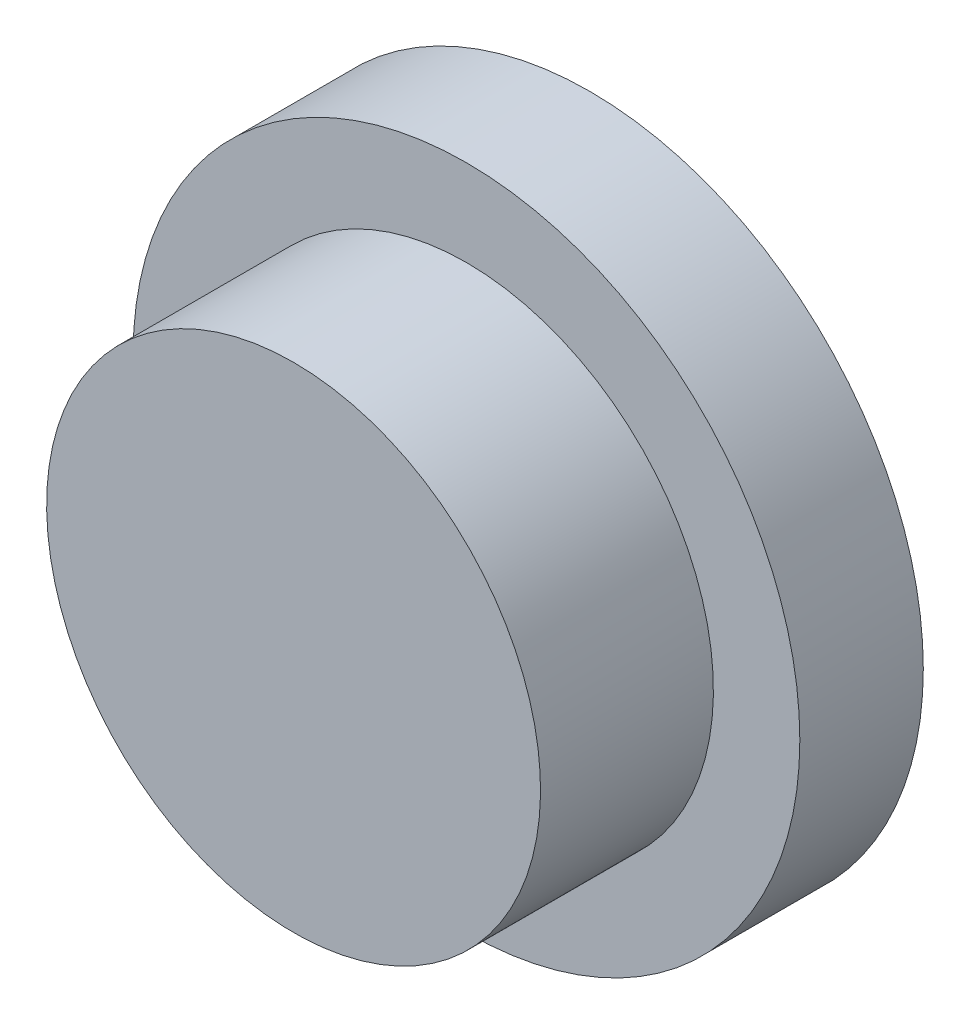
ISO-10303-21;
HEADER;
FILE_DESCRIPTION(('STEP AP214'),'2;1');
FILE_NAME('part.step','',(''),(''),'','','');
FILE_SCHEMA(('AUTOMOTIVE_DESIGN { 1 0 10303 214 1 1 1 1 }'));
ENDSEC;
DATA;
#1=APPLICATION_CONTEXT('core data for automotive mechanical design processes');
#2=APPLICATION_PROTOCOL_DEFINITION('international standard','automotive_design',2000,#1);
#3=PRODUCT_CONTEXT('',#1,'mechanical');
#4=PRODUCT('Part','Part','',(#3));
#5=PRODUCT_RELATED_PRODUCT_CATEGORY('part','',(#4));
#6=PRODUCT_DEFINITION_FORMATION('','',#4);
#7=PRODUCT_DEFINITION_CONTEXT('part definition',#1,'design');
#8=PRODUCT_DEFINITION('design','',#6,#7);
#9=PRODUCT_DEFINITION_SHAPE('','',#8);
#10=(LENGTH_UNIT() NAMED_UNIT(*) SI_UNIT(.MILLI.,.METRE.));
#11=(NAMED_UNIT(*) PLANE_ANGLE_UNIT() SI_UNIT($,.RADIAN.));
#12=(NAMED_UNIT(*) SI_UNIT($,.STERADIAN.) SOLID_ANGLE_UNIT());
#13=UNCERTAINTY_MEASURE_WITH_UNIT(LENGTH_MEASURE(1.E-05),#10,'distance_accuracy_value','');
#14=(GEOMETRIC_REPRESENTATION_CONTEXT(3) GLOBAL_UNCERTAINTY_ASSIGNED_CONTEXT((#13)) GLOBAL_UNIT_ASSIGNED_CONTEXT((#10,
#11,#12)) REPRESENTATION_CONTEXT('',''));
#15=CARTESIAN_POINT('',(0.,0.,0.));
#16=DIRECTION('',(0.,0.,1.));
#17=DIRECTION('',(1.,0.,0.));
#18=AXIS2_PLACEMENT_3D('',#15,#16,#17);
#19=CARTESIAN_POINT('',(0.,0.,-1.2));
#20=DIRECTION('',(0.,0.,-1.));
#21=DIRECTION('',(0.,1.,0.));
#22=AXIS2_PLACEMENT_3D('',#19,#20,#21);
#23=CONICAL_SURFACE('',#22,0.7,0.785398163397);
#24=CARTESIAN_POINT('',(0.,0.,-1.2));
#25=DIRECTION('',(0.,0.,-1.));
#26=DIRECTION('',(0.,1.,0.));
#27=AXIS2_PLACEMENT_3D('',#24,#25,#26);
#28=CIRCLE('',#27,0.7);
#29=CARTESIAN_POINT('',(0.,0.7,-1.2));
#30=VERTEX_POINT('',#29);
#31=EDGE_CURVE('E27',#30,#30,#28,.T.);
#32=ORIENTED_EDGE('',*,*,#31,.T.);
#33=DIRECTION('',(0.,-0.707106781186048,0.707106781187048));
#34=VECTOR('',#33,1.);
#35=CARTESIAN_POINT('',(0.,0.7,-1.2));
#36=LINE('',#35,#34);
#37=CARTESIAN_POINT('',(0.,0.,-0.499999999999));
#38=VERTEX_POINT('',#37);
#39=EDGE_CURVE('E11',#30,#38,#36,.T.);
#40=ORIENTED_EDGE('',*,*,#39,.T.);
#41=ORIENTED_EDGE('',*,*,#39,.F.);
#42=EDGE_LOOP('',(#32,#40,#41));
#43=FACE_BOUND('',#42,.T.);
#44=ADVANCED_FACE('F17',(#43),#23,.F.);
#45=CARTESIAN_POINT('',(0.,0.,-1.2));
#46=DIRECTION('',(0.,0.,1.));
#47=DIRECTION('',(1.,0.,0.));
#48=AXIS2_PLACEMENT_3D('',#45,#46,#47);
#49=PLANE('',#48);
#50=ORIENTED_EDGE('',*,*,#31,.F.);
#51=EDGE_LOOP('',(#50));
#52=FACE_BOUND('',#51,.T.);
#53=CARTESIAN_POINT('',(0.,0.,-1.2));
#54=DIRECTION('',(0.,0.,-1.));
#55=DIRECTION('',(0.,1.,0.));
#56=AXIS2_PLACEMENT_3D('',#53,#54,#55);
#57=CIRCLE('',#56,1.35);
#58=CARTESIAN_POINT('',(0.,1.35,-1.2));
#59=VERTEX_POINT('',#58);
#60=EDGE_CURVE('E53',#59,#59,#57,.T.);
#61=ORIENTED_EDGE('',*,*,#60,.T.);
#62=EDGE_LOOP('',(#61));
#63=FACE_BOUND('',#62,.T.);
#64=ADVANCED_FACE('F19',(#52,#63),#49,.F.);
#65=CARTESIAN_POINT('',(0.,0.,-0.7));
#66=DIRECTION('',(0.,0.,-1.));
#67=DIRECTION('',(0.,1.,0.));
#68=AXIS2_PLACEMENT_3D('',#65,#66,#67);
#69=CYLINDRICAL_SURFACE('',#68,1.35);
#70=CARTESIAN_POINT('',(0.,0.,-0.7));
#71=DIRECTION('',(0.,0.,-1.));
#72=DIRECTION('',(0.,1.,0.));
#73=AXIS2_PLACEMENT_3D('',#70,#71,#72);
#74=CIRCLE('',#73,1.35);
#75=CARTESIAN_POINT('',(0.,1.35,-0.7));
#76=VERTEX_POINT('',#75);
#77=EDGE_CURVE('E64',#76,#76,#74,.T.);
#78=ORIENTED_EDGE('',*,*,#77,.T.);
#79=DIRECTION('',(0.,0.,-1.));
#80=VECTOR('',#79,1.);
#81=CARTESIAN_POINT('',(0.,1.35,-0.7));
#82=LINE('',#81,#80);
#83=EDGE_CURVE('E57',#76,#59,#82,.T.);
#84=ORIENTED_EDGE('',*,*,#83,.T.);
#85=ORIENTED_EDGE('',*,*,#60,.F.);
#86=ORIENTED_EDGE('',*,*,#83,.F.);
#87=EDGE_LOOP('',(#78,#84,#85,#86));
#88=FACE_BOUND('',#87,.T.);
#89=ADVANCED_FACE('F78',(#88),#69,.T.);
#90=CARTESIAN_POINT('',(0.,0.,-0.7));
#91=DIRECTION('',(0.,0.,-1.));
#92=DIRECTION('',(0.,-1.,0.));
#93=AXIS2_PLACEMENT_3D('',#90,#91,#92);
#94=PLANE('',#93);
#95=ORIENTED_EDGE('',*,*,#77,.F.);
#96=EDGE_LOOP('',(#95));
#97=FACE_BOUND('',#96,.T.);
#98=CARTESIAN_POINT('',(0.,0.,-0.7));
#99=DIRECTION('',(0.,0.,-1.));
#100=DIRECTION('',(0.,1.,0.));
#101=AXIS2_PLACEMENT_3D('',#98,#99,#100);
#102=CIRCLE('',#101,1.);
#103=CARTESIAN_POINT('',(0.,1.,-0.7));
#104=VERTEX_POINT('',#103);
#105=EDGE_CURVE('E71',#104,#104,#102,.T.);
#106=ORIENTED_EDGE('',*,*,#105,.T.);
#107=EDGE_LOOP('',(#106));
#108=FACE_BOUND('',#107,.T.);
#109=ADVANCED_FACE('F80',(#97,#108),#94,.F.);
#110=CARTESIAN_POINT('',(0.,0.,0.));
#111=DIRECTION('',(0.,0.,-1.));
#112=DIRECTION('',(0.,1.,0.));
#113=AXIS2_PLACEMENT_3D('',#110,#111,#112);
#114=CYLINDRICAL_SURFACE('',#113,1.);
#115=CARTESIAN_POINT('',(0.,0.,0.));
#116=DIRECTION('',(0.,0.,-1.));
#117=DIRECTION('',(0.,1.,0.));
#118=AXIS2_PLACEMENT_3D('',#115,#116,#117);
#119=CIRCLE('',#118,1.);
#120=CARTESIAN_POINT('',(0.,1.,0.));
#121=VERTEX_POINT('',#120);
#122=EDGE_CURVE('E72',#121,#121,#119,.T.);
#123=ORIENTED_EDGE('',*,*,#122,.T.);
#124=DIRECTION('',(0.,0.,-1.));
#125=VECTOR('',#124,1.);
#126=CARTESIAN_POINT('',(0.,1.,0.));
#127=LINE('',#126,#125);
#128=EDGE_CURVE('E68',#121,#104,#127,.T.);
#129=ORIENTED_EDGE('',*,*,#128,.T.);
#130=ORIENTED_EDGE('',*,*,#105,.F.);
#131=ORIENTED_EDGE('',*,*,#128,.F.);
#132=EDGE_LOOP('',(#123,#129,#130,#131));
#133=FACE_BOUND('',#132,.T.);
#134=ADVANCED_FACE('F83',(#133),#114,.T.);
#135=CARTESIAN_POINT('',(0.,0.,0.));
#136=DIRECTION('',(0.,0.,-1.));
#137=DIRECTION('',(0.,-1.,0.));
#138=AXIS2_PLACEMENT_3D('',#135,#136,#137);
#139=PLANE('',#138);
#140=ORIENTED_EDGE('',*,*,#122,.F.);
#141=EDGE_LOOP('',(#140));
#142=FACE_BOUND('',#141,.T.);
#143=ADVANCED_FACE('F97',(#142),#139,.F.);
#144=CLOSED_SHELL('',(#44,#64,#89,#109,#134,#143));
#145=MANIFOLD_SOLID_BREP('B1',#144);
#146=ADVANCED_BREP_SHAPE_REPRESENTATION('',(#18,#145),#14);
#147=SHAPE_DEFINITION_REPRESENTATION(#9,#146);
ENDSEC;
END-ISO-10303-21;
